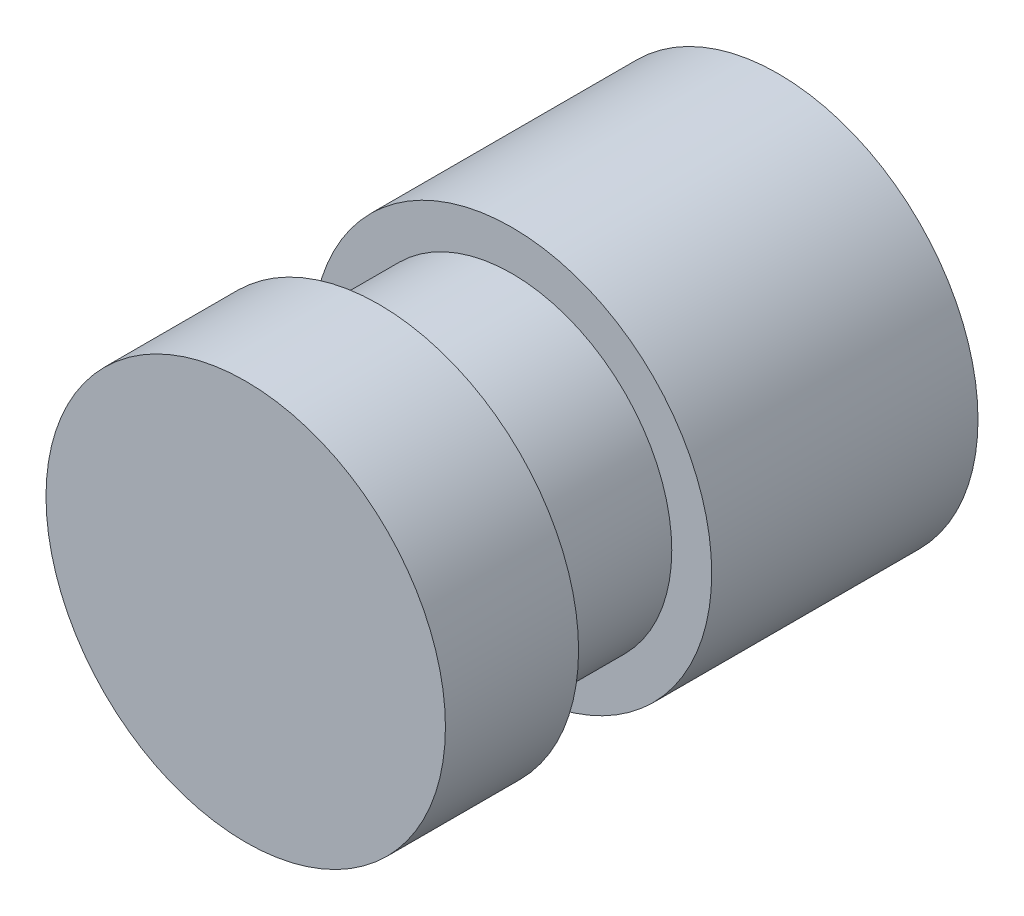
ISO-10303-21;
HEADER;
FILE_DESCRIPTION(('STEP AP214'),'2;1');
FILE_NAME('part.step','',(''),(''),'','','');
FILE_SCHEMA(('AUTOMOTIVE_DESIGN { 1 0 10303 214 1 1 1 1 }'));
ENDSEC;
DATA;
#1=APPLICATION_CONTEXT('core data for automotive mechanical design processes');
#2=APPLICATION_PROTOCOL_DEFINITION('international standard','automotive_design',2000,#1);
#3=PRODUCT_CONTEXT('',#1,'mechanical');
#4=PRODUCT('Part','Part','',(#3));
#5=PRODUCT_RELATED_PRODUCT_CATEGORY('part','',(#4));
#6=PRODUCT_DEFINITION_FORMATION('','',#4);
#7=PRODUCT_DEFINITION_CONTEXT('part definition',#1,'design');
#8=PRODUCT_DEFINITION('design','',#6,#7);
#9=PRODUCT_DEFINITION_SHAPE('','',#8);
#10=(LENGTH_UNIT() NAMED_UNIT(*) SI_UNIT(.MILLI.,.METRE.));
#11=(NAMED_UNIT(*) PLANE_ANGLE_UNIT() SI_UNIT($,.RADIAN.));
#12=(NAMED_UNIT(*) SI_UNIT($,.STERADIAN.) SOLID_ANGLE_UNIT());
#13=UNCERTAINTY_MEASURE_WITH_UNIT(LENGTH_MEASURE(1.E-05),#10,'distance_accuracy_value','');
#14=(GEOMETRIC_REPRESENTATION_CONTEXT(3) GLOBAL_UNCERTAINTY_ASSIGNED_CONTEXT((#13)) GLOBAL_UNIT_ASSIGNED_CONTEXT((#10,
#11,#12)) REPRESENTATION_CONTEXT('',''));
#15=CARTESIAN_POINT('',(0.,0.,0.));
#16=DIRECTION('',(0.,0.,1.));
#17=DIRECTION('',(1.,0.,0.));
#18=AXIS2_PLACEMENT_3D('',#15,#16,#17);
#19=CARTESIAN_POINT('',(0.,0.,-20.));
#20=DIRECTION('',(0.,0.,1.));
#21=DIRECTION('',(1.,0.,0.));
#22=AXIS2_PLACEMENT_3D('',#19,#20,#21);
#23=CYLINDRICAL_SURFACE('',#22,7.5);
#24=CARTESIAN_POINT('',(0.,0.,-5.));
#25=DIRECTION('',(0.,0.,1.));
#26=DIRECTION('',(1.,0.,0.));
#27=AXIS2_PLACEMENT_3D('',#24,#25,#26);
#28=CIRCLE('',#27,7.5);
#29=CARTESIAN_POINT('',(7.5,0.,-5.));
#30=VERTEX_POINT('',#29);
#31=EDGE_CURVE('E42',#30,#30,#28,.T.);
#32=ORIENTED_EDGE('',*,*,#31,.T.);
#33=EDGE_LOOP('',(#32));
#34=FACE_BOUND('',#33,.T.);
#35=CARTESIAN_POINT('',(0.,0.,0.));
#36=DIRECTION('',(0.,0.,1.));
#37=DIRECTION('',(1.,0.,0.));
#38=AXIS2_PLACEMENT_3D('',#35,#36,#37);
#39=CIRCLE('',#38,7.5);
#40=CARTESIAN_POINT('',(7.5,0.,0.));
#41=VERTEX_POINT('',#40);
#42=EDGE_CURVE('E35',#41,#41,#39,.T.);
#43=ORIENTED_EDGE('',*,*,#42,.F.);
#44=EDGE_LOOP('',(#43));
#45=FACE_BOUND('',#44,.T.);
#46=ADVANCED_FACE('F32',(#34,#45),#23,.T.);
#47=CARTESIAN_POINT('',(0.,0.,0.));
#48=DIRECTION('',(0.,0.,1.));
#49=DIRECTION('',(1.,0.,0.));
#50=AXIS2_PLACEMENT_3D('',#47,#48,#49);
#51=PLANE('',#50);
#52=ORIENTED_EDGE('',*,*,#42,.T.);
#53=EDGE_LOOP('',(#52));
#54=FACE_BOUND('',#53,.T.);
#55=ADVANCED_FACE('F73',(#54),#51,.T.);
#56=CARTESIAN_POINT('',(0.,0.,-5.));
#57=DIRECTION('',(0.,0.,1.));
#58=DIRECTION('',(1.,0.,0.));
#59=AXIS2_PLACEMENT_3D('',#56,#57,#58);
#60=PLANE('',#59);
#61=ORIENTED_EDGE('',*,*,#31,.F.);
#62=EDGE_LOOP('',(#61));
#63=FACE_BOUND('',#62,.T.);
#64=CARTESIAN_POINT('',(0.,0.,-5.));
#65=DIRECTION('',(0.,0.,1.));
#66=DIRECTION('',(1.,0.,0.));
#67=AXIS2_PLACEMENT_3D('',#64,#65,#66);
#68=CIRCLE('',#67,6.);
#69=CARTESIAN_POINT('',(6.,0.,-5.));
#70=VERTEX_POINT('',#69);
#71=EDGE_CURVE('E46',#70,#70,#68,.T.);
#72=ORIENTED_EDGE('',*,*,#71,.T.);
#73=EDGE_LOOP('',(#72));
#74=FACE_BOUND('',#73,.T.);
#75=ADVANCED_FACE('F78',(#63,#74),#60,.F.);
#76=CARTESIAN_POINT('',(0.,0.,-5.));
#77=DIRECTION('',(0.,0.,-1.));
#78=DIRECTION('',(-1.,0.,0.));
#79=AXIS2_PLACEMENT_3D('',#76,#77,#78);
#80=CYLINDRICAL_SURFACE('',#79,6.);
#81=ORIENTED_EDGE('',*,*,#71,.F.);
#82=EDGE_LOOP('',(#81));
#83=FACE_BOUND('',#82,.T.);
#84=CARTESIAN_POINT('',(0.,0.,-10.));
#85=DIRECTION('',(0.,0.,1.));
#86=DIRECTION('',(1.,0.,0.));
#87=AXIS2_PLACEMENT_3D('',#84,#85,#86);
#88=CIRCLE('',#87,6.);
#89=CARTESIAN_POINT('',(6.,0.,-10.));
#90=VERTEX_POINT('',#89);
#91=EDGE_CURVE('E52',#90,#90,#88,.T.);
#92=ORIENTED_EDGE('',*,*,#91,.T.);
#93=EDGE_LOOP('',(#92));
#94=FACE_BOUND('',#93,.T.);
#95=ADVANCED_FACE('F56',(#83,#94),#80,.T.);
#96=CARTESIAN_POINT('',(0.,0.,-10.));
#97=DIRECTION('',(0.,0.,1.));
#98=DIRECTION('',(1.,0.,0.));
#99=AXIS2_PLACEMENT_3D('',#96,#97,#98);
#100=PLANE('',#99);
#101=ORIENTED_EDGE('',*,*,#91,.F.);
#102=EDGE_LOOP('',(#101));
#103=FACE_BOUND('',#102,.T.);
#104=CARTESIAN_POINT('',(0.,0.,-10.));
#105=DIRECTION('',(0.,0.,1.));
#106=DIRECTION('',(1.,0.,0.));
#107=AXIS2_PLACEMENT_3D('',#104,#105,#106);
#108=CIRCLE('',#107,7.5);
#109=CARTESIAN_POINT('',(7.5,0.,-10.));
#110=VERTEX_POINT('',#109);
#111=EDGE_CURVE('E49',#110,#110,#108,.T.);
#112=ORIENTED_EDGE('',*,*,#111,.T.);
#113=EDGE_LOOP('',(#112));
#114=FACE_BOUND('',#113,.T.);
#115=ADVANCED_FACE('F58',(#103,#114),#100,.T.);
#116=CARTESIAN_POINT('',(0.,0.,-20.));
#117=DIRECTION('',(0.,0.,1.));
#118=DIRECTION('',(1.,0.,0.));
#119=AXIS2_PLACEMENT_3D('',#116,#117,#118);
#120=PLANE('',#119);
#121=CARTESIAN_POINT('',(0.,0.,-20.));
#122=DIRECTION('',(0.,0.,1.));
#123=DIRECTION('',(1.,0.,0.));
#124=AXIS2_PLACEMENT_3D('',#121,#122,#123);
#125=CIRCLE('',#124,7.5);
#126=CARTESIAN_POINT('',(7.5,0.,-20.));
#127=VERTEX_POINT('',#126);
#128=EDGE_CURVE('E10',#127,#127,#125,.T.);
#129=ORIENTED_EDGE('',*,*,#128,.F.);
#130=EDGE_LOOP('',(#129));
#131=FACE_BOUND('',#130,.T.);
#132=ADVANCED_FACE('F61',(#131),#120,.F.);
#133=ORIENTED_EDGE('',*,*,#128,.T.);
#134=EDGE_LOOP('',(#133));
#135=FACE_BOUND('',#134,.T.);
#136=ORIENTED_EDGE('',*,*,#111,.F.);
#137=EDGE_LOOP('',(#136));
#138=FACE_BOUND('',#137,.T.);
#139=ADVANCED_FACE('F65',(#135,#138),#23,.T.);
#140=CLOSED_SHELL('',(#46,#55,#75,#95,#115,#132,#139));
#141=MANIFOLD_SOLID_BREP('B2',#140);
#142=ADVANCED_BREP_SHAPE_REPRESENTATION('',(#18,#141),#14);
#143=SHAPE_DEFINITION_REPRESENTATION(#9,#142);
ENDSEC;
END-ISO-10303-21;
